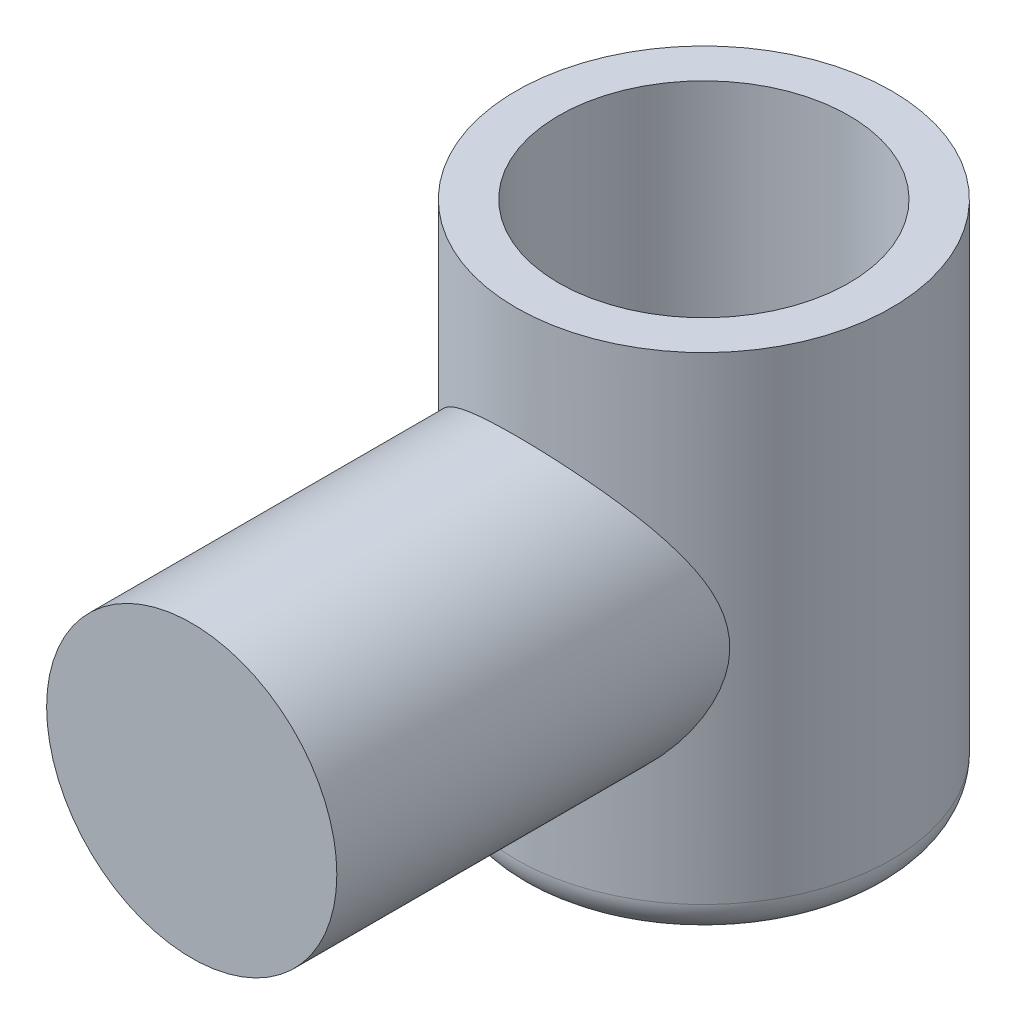
ISO-10303-21;
HEADER;
FILE_DESCRIPTION(('STEP AP214'),'2;1');
FILE_NAME('part.step','',(''),(''),'','','');
FILE_SCHEMA(('AUTOMOTIVE_DESIGN { 1 0 10303 214 1 1 1 1 }'));
ENDSEC;
DATA;
#1=APPLICATION_CONTEXT('core data for automotive mechanical design processes');
#2=APPLICATION_PROTOCOL_DEFINITION('international standard','automotive_design',2000,#1);
#3=PRODUCT_CONTEXT('',#1,'mechanical');
#4=PRODUCT('Part','Part','',(#3));
#5=PRODUCT_RELATED_PRODUCT_CATEGORY('part','',(#4));
#6=PRODUCT_DEFINITION_FORMATION('','',#4);
#7=PRODUCT_DEFINITION_CONTEXT('part definition',#1,'design');
#8=PRODUCT_DEFINITION('design','',#6,#7);
#9=PRODUCT_DEFINITION_SHAPE('','',#8);
#10=(LENGTH_UNIT() NAMED_UNIT(*) SI_UNIT(.MILLI.,.METRE.));
#11=(NAMED_UNIT(*) PLANE_ANGLE_UNIT() SI_UNIT($,.RADIAN.));
#12=(NAMED_UNIT(*) SI_UNIT($,.STERADIAN.) SOLID_ANGLE_UNIT());
#13=UNCERTAINTY_MEASURE_WITH_UNIT(LENGTH_MEASURE(1.E-05),#10,'distance_accuracy_value','');
#14=(GEOMETRIC_REPRESENTATION_CONTEXT(3) GLOBAL_UNCERTAINTY_ASSIGNED_CONTEXT((#13)) GLOBAL_UNIT_ASSIGNED_CONTEXT((#10,
#11,#12)) REPRESENTATION_CONTEXT('',''));
#15=CARTESIAN_POINT('',(0.,0.,0.));
#16=DIRECTION('',(0.,0.,1.));
#17=DIRECTION('',(1.,0.,0.));
#18=AXIS2_PLACEMENT_3D('',#15,#16,#17);
#19=CARTESIAN_POINT('',(0.,75.,0.));
#20=DIRECTION('',(0.,-1.,0.));
#21=DIRECTION('',(0.,0.,-1.));
#22=AXIS2_PLACEMENT_3D('',#19,#20,#21);
#23=CYLINDRICAL_SURFACE('',#22,55.);
#24=CARTESIAN_POINT('',(0.,-65.,0.));
#25=DIRECTION('',(0.,1.,0.));
#26=DIRECTION('',(0.,0.,1.));
#27=AXIS2_PLACEMENT_3D('',#24,#25,#26);
#28=CIRCLE('',#27,55.);
#29=CARTESIAN_POINT('',(0.,-65.,55.));
#30=VERTEX_POINT('',#29);
#31=EDGE_CURVE('E48',#30,#30,#28,.T.);
#32=ORIENTED_EDGE('',*,*,#31,.T.);
#33=EDGE_LOOP('',(#32));
#34=FACE_BOUND('',#33,.T.);
#35=CARTESIAN_POINT('',(0.,75.,0.));
#36=DIRECTION('',(0.,1.,0.));
#37=DIRECTION('',(0.,0.,1.));
#38=AXIS2_PLACEMENT_3D('',#35,#36,#37);
#39=CIRCLE('',#38,55.);
#40=CARTESIAN_POINT('',(0.,75.,55.));
#41=VERTEX_POINT('',#40);
#42=EDGE_CURVE('E63',#41,#41,#39,.T.);
#43=ORIENTED_EDGE('',*,*,#42,.F.);
#44=EDGE_LOOP('',(#43));
#45=FACE_BOUND('',#44,.T.);
#46=CARTESIAN_POINT('',(-42.5,0.,34.9106001094223));
#47=CARTESIAN_POINT('',(-42.5000002288912,-0.489144984326431,34.9105997851786));
#48=CARTESIAN_POINT('',(-42.4915493792357,-0.97829393035291,34.9208955316221));
#49=CARTESIAN_POINT('',(-42.457817106543,-1.95515688155256,34.9619001599965));
#50=CARTESIAN_POINT('',(-42.4325352422677,-2.44287084876996,34.9926095770876));
#51=CARTESIAN_POINT('',(-42.3653387466732,-3.41550494602071,35.0739342720024));
#52=CARTESIAN_POINT('',(-42.3234234950536,-3.9004249711767,35.1245502921923));
#53=CARTESIAN_POINT('',(-42.2232851714191,-4.86621941100944,35.2448610571616));
#54=CARTESIAN_POINT('',(-42.1650596238841,-5.34709320014169,35.3145586980467));
#55=CARTESIAN_POINT('',(-41.9660754884727,-6.78497820199617,35.5512536730363));
#56=CARTESIAN_POINT('',(-41.8012124811986,-7.73435800642852,35.7456011158556));
#57=CARTESIAN_POINT('',(-41.4113987075601,-9.60523078809301,36.1964682107257));
#58=CARTESIAN_POINT('',(-41.1864383853928,-10.526719304493,36.4529977494698));
#59=CARTESIAN_POINT('',(-40.625839626523,-12.5339047626655,37.077660706149));
#60=CARTESIAN_POINT('',(-40.2767899053382,-13.6120680336423,37.4579319519364));
#61=CARTESIAN_POINT('',(-39.502312406044,-15.7187150287624,38.2737974254088));
#62=CARTESIAN_POINT('',(-39.0768618191511,-16.7471838003834,38.7094081628024));
#63=CARTESIAN_POINT('',(-38.1541475858732,-18.7545230170705,39.6192021057817));
#64=CARTESIAN_POINT('',(-37.6568262209241,-19.7333527358697,40.0934161782856));
#65=CARTESIAN_POINT('',(-36.5940886947428,-21.6405718331285,41.0656968927172));
#66=CARTESIAN_POINT('',(-36.0286789558901,-22.5689659569154,41.5637612823181));
#67=CARTESIAN_POINT('',(-34.8161911063448,-24.3991636008043,42.5849452621606));
#68=CARTESIAN_POINT('',(-34.1673571583866,-25.2996270102167,43.1083793188185));
#69=CARTESIAN_POINT('',(-32.8017071071619,-27.0467618949143,44.1564155957314));
#70=CARTESIAN_POINT('',(-32.0848884748354,-27.8934313670834,44.6810178587349));
#71=CARTESIAN_POINT('',(-30.5847654803962,-29.5305572948476,45.7209427029055));
#72=CARTESIAN_POINT('',(-29.8015066541491,-30.3210515789884,46.2362713509327));
#73=CARTESIAN_POINT('',(-28.1689583325873,-31.8434494585851,47.2486214887345));
#74=CARTESIAN_POINT('',(-27.3196727402465,-32.575356512066,47.7456440580624));
#75=CARTESIAN_POINT('',(-25.594741173882,-33.945822343589,48.6912095230291));
#76=CARTESIAN_POINT('',(-24.72187161527,-34.5870634828419,49.1409219510165));
#77=CARTESIAN_POINT('',(-22.9182735623926,-35.8076562583811,50.0075352606361));
#78=CARTESIAN_POINT('',(-21.9875441987151,-36.3870069643345,50.4244356490151));
#79=CARTESIAN_POINT('',(-20.0714287908287,-37.4780239485196,51.217301799851));
#80=CARTESIAN_POINT('',(-19.0860806014535,-37.9897362927697,51.5932953912362));
#81=CARTESIAN_POINT('',(-17.0640681321183,-38.9398857441942,52.2968713559347));
#82=CARTESIAN_POINT('',(-16.0274125252987,-39.3783351814569,52.6244618743697));
#83=CARTESIAN_POINT('',(-14.0689559091464,-40.1152994850695,53.1783562571218));
#84=CARTESIAN_POINT('',(-13.1535489443157,-40.4249510711338,53.4124861195881));
#85=CARTESIAN_POINT('',(-11.2942726185532,-40.9833041668282,53.8363088428573));
#86=CARTESIAN_POINT('',(-10.3504059701077,-41.2320114645527,54.026005923523));
#87=CARTESIAN_POINT('',(-8.44015207584697,-41.665002526401,54.3571797125297));
#88=CARTESIAN_POINT('',(-7.4737761765878,-41.8493180305475,54.4986801770982));
#89=CARTESIAN_POINT('',(-5.52451086864476,-42.1509470517049,54.730640675359));
#90=CARTESIAN_POINT('',(-4.5416212731446,-42.2682598102003,54.8211001312332));
#91=CARTESIAN_POINT('',(-2.56368857017137,-42.4342465292041,54.9491808198944));
#92=CARTESIAN_POINT('',(-1.56861822921805,-42.4827177009214,54.9866459443309));
#93=CARTESIAN_POINT('',(0.423039341333031,-42.5095622367977,55.0073886621494));
#94=CARTESIAN_POINT('',(1.41962657400653,-42.4879354586324,54.9906661455108));
#95=CARTESIAN_POINT('',(3.40656238673651,-42.3749415857675,54.9034096745233));
#96=CARTESIAN_POINT('',(4.39691022459702,-42.2835663464949,54.8328694358445));
#97=CARTESIAN_POINT('',(6.36370590413462,-42.03255987222,54.6395432558043));
#98=CARTESIAN_POINT('',(7.34015394373417,-41.8729296101235,54.5167580591416));
#99=CARTESIAN_POINT('',(9.23010002572843,-41.4963003951078,54.2280279248772));
#100=CARTESIAN_POINT('',(10.1444857875692,-41.2821084508025,54.0641998867618));
#101=CARTESIAN_POINT('',(11.9490403604779,-40.7963668173438,53.6942155727445));
#102=CARTESIAN_POINT('',(12.8392100607106,-40.5248192373904,53.4880608533746));
#103=CARTESIAN_POINT('',(14.5911042584072,-39.9275135843936,53.0369496202634));
#104=CARTESIAN_POINT('',(15.4528257553072,-39.60174981467,52.791989029187));
#105=CARTESIAN_POINT('',(17.1442933501702,-38.899382827112,52.2671744266677));
#106=CARTESIAN_POINT('',(17.9740375393873,-38.522776580481,51.9873183365002));
#107=CARTESIAN_POINT('',(19.6837958371438,-37.6802190386756,51.3659386528833));
#108=CARTESIAN_POINT('',(20.5600030565747,-37.2090438996185,51.0210269275216));
#109=CARTESIAN_POINT('',(22.267540654016,-36.2130338409741,50.299264721007));
#110=CARTESIAN_POINT('',(23.0988684038329,-35.6881957840218,49.9224123726883));
#111=CARTESIAN_POINT('',(24.7153332647529,-34.5884156820301,49.1422236946961));
#112=CARTESIAN_POINT('',(25.5004441782203,-34.0134456696103,48.7388726133643));
#113=CARTESIAN_POINT('',(27.0228293792587,-32.8169795483925,47.9115579848606));
#114=CARTESIAN_POINT('',(27.760101400157,-32.19548123802,47.487593462658));
#115=CARTESIAN_POINT('',(29.3304821825736,-30.7783477350251,46.5373693848213));
#116=CARTESIAN_POINT('',(30.1527706068329,-29.9729330412174,46.0077784030319));
#117=CARTESIAN_POINT('',(31.7262057612385,-28.3022098910415,44.9372175215653));
#118=CARTESIAN_POINT('',(32.477339472655,-27.436890524227,44.3962455616244));
#119=CARTESIAN_POINT('',(33.9079008374094,-25.6479460113038,43.3135022961492));
#120=CARTESIAN_POINT('',(34.5872699056562,-24.7242741971617,42.7717306980876));
#121=CARTESIAN_POINT('',(35.8719733800114,-22.8203893907002,41.7001287343741));
#122=CARTESIAN_POINT('',(36.4773210862751,-21.8401866025813,41.170296237502));
#123=CARTESIAN_POINT('',(37.517968655817,-19.9896300508913,40.2220436202053));
#124=CARTESIAN_POINT('',(37.9648492101728,-19.1278128186681,39.7996579049517));
#125=CARTESIAN_POINT('',(38.8030403799898,-17.3645305959694,38.9828980831988));
#126=CARTESIAN_POINT('',(39.1943491287326,-16.4630642749686,38.5885249178945));
#127=CARTESIAN_POINT('',(39.9175389259675,-14.6224495800559,37.839932930076));
#128=CARTESIAN_POINT('',(40.2495261990121,-13.6833723232868,37.485642758672));
#129=CARTESIAN_POINT('',(40.8507404541482,-11.7674970009387,36.8295424232635));
#130=CARTESIAN_POINT('',(41.119988256823,-10.7907115749055,36.5277148576057));
#131=CARTESIAN_POINT('',(41.5345815990419,-9.0406164879871,36.0548539750549));
#132=CARTESIAN_POINT('',(41.6941603323237,-8.27445695288276,35.8698008029623));
#133=CARTESIAN_POINT('',(41.9718928045791,-6.72526146381531,35.544424338069));
#134=CARTESIAN_POINT('',(42.0900521372401,-5.94222780387467,35.4040950055495));
#135=CARTESIAN_POINT('',(42.2827511759414,-4.36456911454335,35.1737348044515));
#136=CARTESIAN_POINT('',(42.3573534812163,-3.56996241065757,35.0836317601953));
#137=CARTESIAN_POINT('',(42.4616901072443,-1.97348820605073,34.9572837445148));
#138=CARTESIAN_POINT('',(42.4914246243284,-1.17162073711653,34.9210385374211));
#139=CARTESIAN_POINT('',(42.5053850426105,0.435176174921347,34.9040453977496));
#140=CARTESIAN_POINT('',(42.4894934910472,1.24010818406595,34.9234406974643));
#141=CARTESIAN_POINT('',(42.4123072502091,2.84452532357319,35.0171357291868));
#142=CARTESIAN_POINT('',(42.3510126231658,3.64401046140003,35.0914353859403));
#143=CARTESIAN_POINT('',(42.1842029453717,5.23277556096707,35.2917822760301));
#144=CARTESIAN_POINT('',(42.0786310171087,6.02204104565627,35.4178960642378));
#145=CARTESIAN_POINT('',(41.8252151915092,7.58474371443984,35.7167972394694));
#146=CARTESIAN_POINT('',(41.6773650038227,8.35817852481185,35.8895915716234));
#147=CARTESIAN_POINT('',(41.2864540274045,10.1369737314797,36.3392929742949));
#148=CARTESIAN_POINT('',(41.0280714692369,11.135049070886,36.6317541295531));
#149=CARTESIAN_POINT('',(40.4458536693613,13.0930239692896,37.2735875059239));
#150=CARTESIAN_POINT('',(40.121994696536,14.0529095354823,37.6229803522897));
#151=CARTESIAN_POINT('',(39.4124859714239,15.9348611614238,38.3656134386276));
#152=CARTESIAN_POINT('',(39.0266847690216,16.8568273830052,38.758960411771));
#153=CARTESIAN_POINT('',(38.1973396307715,18.6600707856831,39.5765363675372));
#154=CARTESIAN_POINT('',(37.7537950933454,19.5413475427413,40.0007656718762));
#155=CARTESIAN_POINT('',(36.9662771061941,20.9804343859473,40.7268929652843));
#156=CARTESIAN_POINT('',(36.6374349767591,21.5494339692057,41.0232163817058));
#157=CARTESIAN_POINT('',(35.9553766684857,22.6691559838573,41.6223140325529));
#158=CARTESIAN_POINT('',(35.6021589373846,23.2198772479558,41.9250886769489));
#159=CARTESIAN_POINT('',(34.5064155517986,24.8448219464773,42.8393677482624));
#160=CARTESIAN_POINT('',(33.7278464736521,25.8917410569612,43.4567835402315));
#161=CARTESIAN_POINT('',(32.0777539257044,27.9099592557178,44.6886812058769));
#162=CARTESIAN_POINT('',(31.2062807938561,28.8812988064525,45.303164481789));
#163=CARTESIAN_POINT('',(29.3714911273789,30.7453189878156,46.5136833701093));
#164=CARTESIAN_POINT('',(28.4082010753147,31.6380221572932,47.1097242365181));
#165=CARTESIAN_POINT('',(26.5620447442271,33.1950093306779,48.1704448481396));
#166=CARTESIAN_POINT('',(25.6931559813475,33.8723827186685,48.6402848971226));
#167=CARTESIAN_POINT('',(23.8943556587282,35.1644095689693,49.5487098496071));
#168=CARTESIAN_POINT('',(22.9644462466236,35.7790652367004,49.9872958519696));
#169=CARTESIAN_POINT('',(21.0471403281283,36.9394348124103,50.8243118571386));
#170=CARTESIAN_POINT('',(20.0598193654954,37.4852364501289,51.2227928257231));
#171=CARTESIAN_POINT('',(18.0302370523761,38.5025757457105,51.9719144140954));
#172=CARTESIAN_POINT('',(16.9879849733342,38.9741258827359,52.3225630715474));
#173=CARTESIAN_POINT('',(15.0260992001812,39.7667961530003,52.9158834491261));
#174=CARTESIAN_POINT('',(14.1138078102259,40.0999119714526,53.1668486930162));
#175=CARTESIAN_POINT('',(12.2585593585735,40.7053988068652,53.6249967353162));
#176=CARTESIAN_POINT('',(11.3156054482693,40.9777760438686,53.8321840167727));
#177=CARTESIAN_POINT('',(9.40464298303717,41.4580857223377,54.1986972401111));
#178=CARTESIAN_POINT('',(8.43664406159891,41.6660425550706,54.3580412959979));
#179=CARTESIAN_POINT('',(6.48156234335323,42.0145831456137,54.6256598599935));
#180=CARTESIAN_POINT('',(5.49447931403791,42.1551660820471,54.7339337454892));
#181=CARTESIAN_POINT('',(3.50502362873863,42.3670733476336,54.8973070486375));
#182=CARTESIAN_POINT('',(2.50260987888923,42.4381562865927,54.9522211308231));
#183=CARTESIAN_POINT('',(0.493748792290042,42.5090145592549,55.0069614539599));
#184=CARTESIAN_POINT('',(-0.512698551775252,42.5087897635725,55.0067875949558));
#185=CARTESIAN_POINT('',(-2.52154087716589,42.437036450201,54.9513562197786));
#186=CARTESIAN_POINT('',(-3.52393572265733,42.3655055620068,54.8960968723393));
#187=CARTESIAN_POINT('',(-5.51673467352634,42.1523403569969,54.7317566995921));
#188=CARTESIAN_POINT('',(-6.50713905470985,42.0107076558211,54.6226771146821));
#189=CARTESIAN_POINT('',(-8.41563515634282,41.6691207400988,54.3604116543332));
#190=CARTESIAN_POINT('',(-9.33474270210213,41.4727310942901,54.2099272693806));
#191=CARTESIAN_POINT('',(-11.1502643764458,41.0219019735116,53.8658076806591));
#192=CARTESIAN_POINT('',(-12.0466795113652,40.7674650777775,53.6721743941507));
#193=CARTESIAN_POINT('',(-13.8123596026901,40.2035797235384,53.2451305484176));
#194=CARTESIAN_POINT('',(-14.6816214397027,39.8941249716639,53.0117154387658));
#195=CARTESIAN_POINT('',(-16.3892176622093,39.2235276573297,52.5089126749995));
#196=CARTESIAN_POINT('',(-17.227550219405,38.8623820454462,52.239522898677));
#197=CARTESIAN_POINT('',(-18.947506309198,38.0555777278059,51.6420054665057));
#198=CARTESIAN_POINT('',(-19.8258088341394,37.6051683773719,51.3107379993337));
#199=CARTESIAN_POINT('',(-21.5391589454668,36.6507367118262,50.6154089925646));
#200=CARTESIAN_POINT('',(-22.3742043001149,36.1467116346429,50.2513457636067));
#201=CARTESIAN_POINT('',(-23.999509199662,35.0886636820461,49.4957278598706));
#202=CARTESIAN_POINT('',(-24.7897473161003,34.5346172074762,49.1041602285745));
#203=CARTESIAN_POINT('',(-26.3237569293407,33.3801064079904,48.2991748466065));
#204=CARTESIAN_POINT('',(-27.0675261098221,32.7796397725178,47.8857560086183));
#205=CARTESIAN_POINT('',(-28.6509573580584,31.4113753866856,46.9587378664033));
#206=CARTESIAN_POINT('',(-29.4802989453421,30.6340396428969,46.4415581106478));
#207=CARTESIAN_POINT('',(-31.0701027091918,29.0203722609395,45.3933418977294));
#208=CARTESIAN_POINT('',(-31.8305534878249,28.1840309009036,44.8623031662621));
#209=CARTESIAN_POINT('',(-33.2821953978982,26.4541419610359,43.7961985858952));
#210=CARTESIAN_POINT('',(-33.9733248062038,25.5605445407598,43.2611295962358));
#211=CARTESIAN_POINT('',(-35.2842083300915,23.7181943220513,42.198768040696));
#212=CARTESIAN_POINT('',(-35.9039717019361,22.7694487004825,41.6714744740866));
#213=CARTESIAN_POINT('',(-37.0001203060926,20.9342354675197,40.6996494906342));
#214=CARTESIAN_POINT('',(-37.4847864890803,20.0539512809718,40.2527782799644));
#215=CARTESIAN_POINT('',(-38.3951051836026,18.2506442627443,39.3854163248202));
#216=CARTESIAN_POINT('',(-38.8207553017178,17.3276196997362,38.9649266506376));
#217=CARTESIAN_POINT('',(-39.6093170099397,15.4401046464797,38.1630433572948));
#218=CARTESIAN_POINT('',(-39.9723051910933,14.4756666030005,37.7816022450413));
#219=CARTESIAN_POINT('',(-40.6317973431999,12.5054129724264,37.0714448177416));
#220=CARTESIAN_POINT('',(-40.9283192071307,11.4996086077943,36.7427143196034));
#221=CARTESIAN_POINT('',(-41.4014899159746,9.63899637832376,36.2080066033364));
#222=CARTESIAN_POINT('',(-41.5901609644238,8.79055299382779,35.9905715704425));
#223=CARTESIAN_POINT('',(-41.9166090800101,7.07196120855194,35.6098429311225));
#224=CARTESIAN_POINT('',(-42.0543943038685,6.20181631029908,35.4465406479408));
#225=CARTESIAN_POINT('',(-42.2758893719668,4.44728055097971,35.1820884825305));
#226=CARTESIAN_POINT('',(-42.3597332447172,3.562930639177,35.0807845832094));
#227=CARTESIAN_POINT('',(-42.4437872790948,2.23016334273372,34.9789438049603));
#228=CARTESIAN_POINT('',(-42.4648533658333,1.78477990634347,34.953349289984));
#229=CARTESIAN_POINT('',(-42.4929588646263,0.892931998867744,34.9191785088844));
#230=CARTESIAN_POINT('',(-42.4999997910793,0.44646764970909,34.9106004053762));
#231=CARTESIAN_POINT('',(-42.5,0.,34.9106001094223));
#232=B_SPLINE_CURVE_WITH_KNOTS('',3,(#46,#47,#48,#49,#50,#51,#52,#53,#54,#55,#56,#57,#58,#59,
#60,#61,#62,#63,#64,#65,#66,#67,#68,#69,#70,#71,#72,#73,#74,#75,#76,#77,#78,#79,#80,#81,#82,#83,
#84,#85,#86,#87,#88,#89,#90,#91,#92,#93,#94,#95,#96,#97,#98,#99,#100,#101,#102,#103,#104,#105,
#106,#107,#108,#109,#110,#111,#112,#113,#114,#115,#116,#117,#118,#119,#120,#121,#122,#123,#124,
#125,#126,#127,#128,#129,#130,#131,#132,#133,#134,#135,#136,#137,#138,#139,#140,#141,#142,#143,
#144,#145,#146,#147,#148,#149,#150,#151,#152,#153,#154,#155,#156,#157,#158,#159,#160,#161,#162,
#163,#164,#165,#166,#167,#168,#169,#170,#171,#172,#173,#174,#175,#176,#177,#178,#179,#180,#181,
#182,#183,#184,#185,#186,#187,#188,#189,#190,#191,#192,#193,#194,#195,#196,#197,#198,#199,#200,
#201,#202,#203,#204,#205,#206,#207,#208,#209,#210,#211,#212,#213,#214,#215,#216,#217,#218,#219,
#220,#221,#222,#223,#224,#225,#226,#227,#228,#229,#230,#231),.UNSPECIFIED.,.T.,.F.,(4,2,2,2,2,2,
2,2,2,2,2,2,2,2,2,2,2,2,2,2,2,2,2,2,2,2,2,2,2,2,2,2,2,2,2,2,2,2,2,2,2,2,2,2,2,2,2,2,2,2,2,2,2,2,
2,2,2,2,2,2,2,2,2,2,2,2,2,2,2,2,2,2,2,2,2,2,2,2,2,2,2,2,2,2,2,2,2,2,2,2,2,2,4),(0.,
1.46726072876535,2.93455992442403,4.40191384447284,5.86949059518675,8.81334224057233,
11.7576622534266,15.338077768014,18.9195639655034,22.5039425623606,26.0879833301006,
29.766218631479,33.4445908185378,37.1204620335439,40.7961161254392,44.3110493456528,
47.8260353946815,51.3386150428796,54.8506029300266,57.8305081307339,60.8101302095212,
63.7882814929021,66.7664664902563,69.7534063514733,72.7403522772671,75.7276470440363,
78.7148992313838,81.5718115660531,84.4286188587187,87.285726515615,90.1430044517774,
93.2988466244722,96.4548734068979,99.6126722641511,102.770620633176,106.567968132271,
110.366009071618,114.167126963974,117.967560864886,121.141357504549,124.315260730355,
127.483422343717,130.650531075769,133.060870695186,135.470884672879,137.877426449219,
140.283957695063,142.696689496426,145.109417990802,147.525255354812,149.941452345179,
153.15145332436,156.362619821126,159.581760727151,162.800935173331,164.963004708631,
167.125212053948,171.449945565368,175.772347614526,180.093506713136,183.683393120231,
187.273153248174,190.858292300084,194.442828166945,197.449117017713,200.45509786256,
203.459939168593,206.464817106685,209.480095020533,212.4953784055,215.510762034122,
218.526076170282,221.378472990296,224.230743093345,227.083339671349,229.936104603371,
233.056601057513,236.177258345305,239.29939567177,242.421688502346,246.164523700657,
249.907977021617,253.654734430697,257.401005332069,260.697840397646,263.994809128556,
267.287719027346,270.57974139517,273.264602494529,275.949033038248,278.626767528987,
279.966156086105,281.305400011879),.UNSPECIFIED.);
#233=CARTESIAN_POINT('',(-42.5,0.,34.9106001094223));
#234=VERTEX_POINT('',#233);
#235=EDGE_CURVE('E53',#234,#234,#232,.T.);
#236=ORIENTED_EDGE('',*,*,#235,.F.);
#237=EDGE_LOOP('',(#236));
#238=FACE_BOUND('',#237,.T.);
#239=ADVANCED_FACE('F39',(#34,#45,#238),#23,.T.);
#240=CARTESIAN_POINT('',(0.,75.,0.));
#241=DIRECTION('',(0.,1.,0.));
#242=DIRECTION('',(0.,0.,1.));
#243=AXIS2_PLACEMENT_3D('',#240,#241,#242);
#244=PLANE('',#243);
#245=CARTESIAN_POINT('',(0.,75.,0.));
#246=DIRECTION('',(0.,1.,0.));
#247=DIRECTION('',(0.,0.,1.));
#248=AXIS2_PLACEMENT_3D('',#245,#246,#247);
#249=CIRCLE('',#248,42.5);
#250=CARTESIAN_POINT('',(0.,75.,42.5));
#251=VERTEX_POINT('',#250);
#252=EDGE_CURVE('E43',#251,#251,#249,.F.);
#253=ORIENTED_EDGE('',*,*,#252,.T.);
#254=EDGE_LOOP('',(#253));
#255=FACE_BOUND('',#254,.T.);
#256=ORIENTED_EDGE('',*,*,#42,.T.);
#257=EDGE_LOOP('',(#256));
#258=FACE_BOUND('',#257,.T.);
#259=ADVANCED_FACE('F76',(#255,#258),#244,.T.);
#260=CARTESIAN_POINT('',(0.,-75.,0.));
#261=DIRECTION('',(0.,1.,0.));
#262=DIRECTION('',(0.,0.,1.));
#263=AXIS2_PLACEMENT_3D('',#260,#261,#262);
#264=PLANE('',#263);
#265=CARTESIAN_POINT('',(0.,-75.,0.));
#266=DIRECTION('',(0.,1.,0.));
#267=DIRECTION('',(0.,0.,1.));
#268=AXIS2_PLACEMENT_3D('',#265,#266,#267);
#269=CIRCLE('',#268,45.);
#270=CARTESIAN_POINT('',(0.,-75.,45.));
#271=VERTEX_POINT('',#270);
#272=EDGE_CURVE('E10',#271,#271,#269,.F.);
#273=ORIENTED_EDGE('',*,*,#272,.T.);
#274=EDGE_LOOP('',(#273));
#275=FACE_BOUND('',#274,.T.);
#276=ADVANCED_FACE('F73',(#275),#264,.F.);
#277=CARTESIAN_POINT('',(0.,0.,150.));
#278=DIRECTION('',(0.,0.,-1.));
#279=DIRECTION('',(-1.,0.,0.));
#280=AXIS2_PLACEMENT_3D('',#277,#278,#279);
#281=CYLINDRICAL_SURFACE('',#280,42.5);
#282=CARTESIAN_POINT('',(0.,0.,150.));
#283=DIRECTION('',(0.,0.,1.));
#284=DIRECTION('',(1.,0.,0.));
#285=AXIS2_PLACEMENT_3D('',#282,#283,#284);
#286=CIRCLE('',#285,42.5);
#287=CARTESIAN_POINT('',(42.5,0.,150.));
#288=VERTEX_POINT('',#287);
#289=EDGE_CURVE('E95',#288,#288,#286,.T.);
#290=ORIENTED_EDGE('',*,*,#289,.F.);
#291=EDGE_LOOP('',(#290));
#292=FACE_BOUND('',#291,.T.);
#293=ORIENTED_EDGE('',*,*,#235,.T.);
#294=EDGE_LOOP('',(#293));
#295=FACE_BOUND('',#294,.T.);
#296=ADVANCED_FACE('F67',(#292,#295),#281,.T.);
#297=CARTESIAN_POINT('',(0.,0.,150.));
#298=DIRECTION('',(0.,0.,1.));
#299=DIRECTION('',(1.,0.,0.));
#300=AXIS2_PLACEMENT_3D('',#297,#298,#299);
#301=PLANE('',#300);
#302=ORIENTED_EDGE('',*,*,#289,.T.);
#303=EDGE_LOOP('',(#302));
#304=FACE_BOUND('',#303,.T.);
#305=ADVANCED_FACE('F72',(#304),#301,.T.);
#306=CARTESIAN_POINT('',(0.,-65.,0.));
#307=DIRECTION('',(0.,1.,0.));
#308=DIRECTION('',(0.,0.,1.));
#309=AXIS2_PLACEMENT_3D('',#306,#307,#308);
#310=TOROIDAL_SURFACE('',#309,45.,10.);
#311=ORIENTED_EDGE('',*,*,#272,.F.);
#312=EDGE_LOOP('',(#311));
#313=FACE_BOUND('',#312,.T.);
#314=ORIENTED_EDGE('',*,*,#31,.F.);
#315=EDGE_LOOP('',(#314));
#316=FACE_BOUND('',#315,.T.);
#317=ADVANCED_FACE('F41',(#313,#316),#310,.T.);
#318=CARTESIAN_POINT('',(0.,110.,0.));
#319=DIRECTION('',(0.,-1.,0.));
#320=DIRECTION('',(0.,0.,-1.));
#321=AXIS2_PLACEMENT_3D('',#318,#319,#320);
#322=CYLINDRICAL_SURFACE('',#321,42.5);
#323=ORIENTED_EDGE('',*,*,#252,.F.);
#324=EDGE_LOOP('',(#323));
#325=FACE_BOUND('',#324,.T.);
#326=CARTESIAN_POINT('',(0.,0.,0.));
#327=DIRECTION('',(0.,1.,0.));
#328=DIRECTION('',(0.,0.,1.));
#329=AXIS2_PLACEMENT_3D('',#326,#327,#328);
#330=CIRCLE('',#329,42.5);
#331=CARTESIAN_POINT('',(0.,0.,42.5));
#332=VERTEX_POINT('',#331);
#333=EDGE_CURVE('E102',#332,#332,#330,.T.);
#334=ORIENTED_EDGE('',*,*,#333,.F.);
#335=EDGE_LOOP('',(#334));
#336=FACE_BOUND('',#335,.T.);
#337=ADVANCED_FACE('F110',(#325,#336),#322,.F.);
#338=CARTESIAN_POINT('',(0.,0.,0.));
#339=DIRECTION('',(0.,1.,0.));
#340=DIRECTION('',(0.,0.,1.));
#341=AXIS2_PLACEMENT_3D('',#338,#339,#340);
#342=PLANE('',#341);
#343=ORIENTED_EDGE('',*,*,#333,.T.);
#344=EDGE_LOOP('',(#343));
#345=FACE_BOUND('',#344,.T.);
#346=ADVANCED_FACE('F108',(#345),#342,.T.);
#347=CLOSED_SHELL('',(#239,#259,#276,#296,#305,#317,#337,#346));
#348=MANIFOLD_SOLID_BREP('B2',#347);
#349=ADVANCED_BREP_SHAPE_REPRESENTATION('',(#18,#348),#14);
#350=SHAPE_DEFINITION_REPRESENTATION(#9,#349);
ENDSEC;
END-ISO-10303-21;
